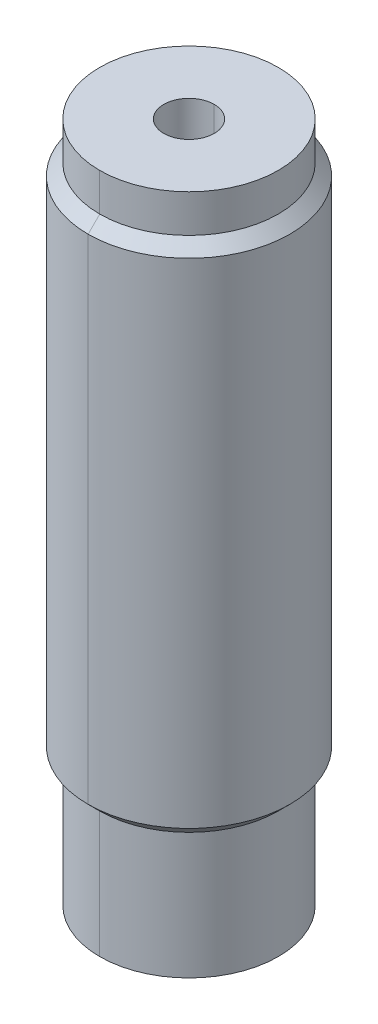
ISO-10303-21;
HEADER;
FILE_DESCRIPTION(('STEP AP214'),'2;1');
FILE_NAME('part.step','',(''),(''),'','','');
FILE_SCHEMA(('AUTOMOTIVE_DESIGN { 1 0 10303 214 1 1 1 1 }'));
ENDSEC;
DATA;
#1=APPLICATION_CONTEXT('core data for automotive mechanical design processes');
#2=APPLICATION_PROTOCOL_DEFINITION('international standard','automotive_design',2000,#1);
#3=PRODUCT_CONTEXT('',#1,'mechanical');
#4=PRODUCT('Part','Part','',(#3));
#5=PRODUCT_RELATED_PRODUCT_CATEGORY('part','',(#4));
#6=PRODUCT_DEFINITION_FORMATION('','',#4);
#7=PRODUCT_DEFINITION_CONTEXT('part definition',#1,'design');
#8=PRODUCT_DEFINITION('design','',#6,#7);
#9=PRODUCT_DEFINITION_SHAPE('','',#8);
#10=(LENGTH_UNIT() NAMED_UNIT(*) SI_UNIT(.MILLI.,.METRE.));
#11=(NAMED_UNIT(*) PLANE_ANGLE_UNIT() SI_UNIT($,.RADIAN.));
#12=(NAMED_UNIT(*) SI_UNIT($,.STERADIAN.) SOLID_ANGLE_UNIT());
#13=UNCERTAINTY_MEASURE_WITH_UNIT(LENGTH_MEASURE(1.E-05),#10,'distance_accuracy_value','');
#14=(GEOMETRIC_REPRESENTATION_CONTEXT(3) GLOBAL_UNCERTAINTY_ASSIGNED_CONTEXT((#13)) GLOBAL_UNIT_ASSIGNED_CONTEXT((#10,
#11,#12)) REPRESENTATION_CONTEXT('',''));
#15=CARTESIAN_POINT('',(0.,0.,0.));
#16=DIRECTION('',(0.,0.,1.));
#17=DIRECTION('',(1.,0.,0.));
#18=AXIS2_PLACEMENT_3D('',#15,#16,#17);
#19=CARTESIAN_POINT('',(0.,-5.,0.));
#20=DIRECTION('',(0.,-1.,0.));
#21=DIRECTION('',(1.,0.,0.));
#22=AXIS2_PLACEMENT_3D('',#19,#20,#21);
#23=CONICAL_SURFACE('',#22,1.,0.7853981634);
#24=DIRECTION('',(0.,-0.707106781184743,0.707106781188352));
#25=VECTOR('',#24,1.);
#26=CARTESIAN_POINT('',(0.,-4.0000000000051,0.));
#27=LINE('',#26,#25);
#28=CARTESIAN_POINT('',(0.,-4.,0.));
#29=VERTEX_POINT('',#28);
#30=CARTESIAN_POINT('',(0.,-5.,1.));
#31=VERTEX_POINT('',#30);
#32=EDGE_CURVE('E11',#29,#31,#27,.T.);
#33=ORIENTED_EDGE('',*,*,#32,.T.);
#34=CARTESIAN_POINT('',(0.,-5.,0.));
#35=DIRECTION('',(0.,-1.,0.));
#36=DIRECTION('',(0.,0.,-1.));
#37=AXIS2_PLACEMENT_3D('',#34,#35,#36);
#38=CIRCLE('',#37,1.);
#39=CARTESIAN_POINT('',(0.,-5.,-1.));
#40=VERTEX_POINT('',#39);
#41=EDGE_CURVE('E26',#31,#40,#38,.T.);
#42=ORIENTED_EDGE('',*,*,#41,.T.);
#43=DIRECTION('',(0.,-0.707106781184743,-0.707106781188352));
#44=VECTOR('',#43,1.);
#45=CARTESIAN_POINT('',(0.,-4.0000000000051,0.));
#46=LINE('',#45,#44);
#47=EDGE_CURVE('E255',#29,#40,#46,.T.);
#48=ORIENTED_EDGE('',*,*,#47,.F.);
#49=EDGE_LOOP('',(#33,#42,#48));
#50=FACE_BOUND('',#49,.T.);
#51=ADVANCED_FACE('F17',(#50),#23,.F.);
#52=CARTESIAN_POINT('',(0.,-5.,0.));
#53=DIRECTION('',(0.,-1.,0.));
#54=DIRECTION('',(-1.,0.,0.));
#55=AXIS2_PLACEMENT_3D('',#52,#53,#54);
#56=CONICAL_SURFACE('',#55,1.,0.7853981634);
#57=ORIENTED_EDGE('',*,*,#47,.T.);
#58=CARTESIAN_POINT('',(0.,-5.,0.));
#59=DIRECTION('',(0.,-1.,0.));
#60=DIRECTION('',(0.,0.,-1.));
#61=AXIS2_PLACEMENT_3D('',#58,#59,#60);
#62=CIRCLE('',#61,1.);
#63=EDGE_CURVE('E250',#40,#31,#62,.T.);
#64=ORIENTED_EDGE('',*,*,#63,.T.);
#65=ORIENTED_EDGE('',*,*,#32,.F.);
#66=EDGE_LOOP('',(#57,#64,#65));
#67=FACE_BOUND('',#66,.T.);
#68=ADVANCED_FACE('F269',(#67),#56,.F.);
#69=CARTESIAN_POINT('',(3.54,-5.,0.));
#70=DIRECTION('',(0.,1.,0.));
#71=DIRECTION('',(0.,0.,1.));
#72=AXIS2_PLACEMENT_3D('',#69,#70,#71);
#73=PLANE('',#72);
#74=ORIENTED_EDGE('',*,*,#63,.F.);
#75=ORIENTED_EDGE('',*,*,#41,.F.);
#76=EDGE_LOOP('',(#74,#75));
#77=FACE_BOUND('',#76,.T.);
#78=CARTESIAN_POINT('',(0.,-5.,0.));
#79=DIRECTION('',(0.,-1.,0.));
#80=DIRECTION('',(0.,0.,-1.));
#81=AXIS2_PLACEMENT_3D('',#78,#79,#80);
#82=CIRCLE('',#81,3.54);
#83=CARTESIAN_POINT('',(0.,-5.,-3.54));
#84=VERTEX_POINT('',#83);
#85=CARTESIAN_POINT('',(0.,-5.,3.54));
#86=VERTEX_POINT('',#85);
#87=EDGE_CURVE('E245',#84,#86,#82,.T.);
#88=ORIENTED_EDGE('',*,*,#87,.T.);
#89=CARTESIAN_POINT('',(0.,-5.,0.));
#90=DIRECTION('',(0.,-1.,0.));
#91=DIRECTION('',(0.,0.,-1.));
#92=AXIS2_PLACEMENT_3D('',#89,#90,#91);
#93=CIRCLE('',#92,3.54);
#94=EDGE_CURVE('E240',#86,#84,#93,.T.);
#95=ORIENTED_EDGE('',*,*,#94,.T.);
#96=EDGE_LOOP('',(#88,#95));
#97=FACE_BOUND('',#96,.T.);
#98=ADVANCED_FACE('F271',(#77,#97),#73,.F.);
#99=CARTESIAN_POINT('',(0.,-4.,0.));
#100=DIRECTION('',(0.,1.,0.));
#101=DIRECTION('',(1.,0.,0.));
#102=AXIS2_PLACEMENT_3D('',#99,#100,#101);
#103=CYLINDRICAL_SURFACE('',#102,3.54);
#104=CARTESIAN_POINT('',(0.,0.,0.));
#105=DIRECTION('',(0.,-1.,0.));
#106=DIRECTION('',(0.,0.,-1.));
#107=AXIS2_PLACEMENT_3D('',#104,#105,#106);
#108=CIRCLE('',#107,3.54);
#109=CARTESIAN_POINT('',(0.,0.,3.54));
#110=VERTEX_POINT('',#109);
#111=CARTESIAN_POINT('',(0.,0.,-3.54));
#112=VERTEX_POINT('',#111);
#113=EDGE_CURVE('E235',#110,#112,#108,.T.);
#114=ORIENTED_EDGE('',*,*,#113,.T.);
#115=DIRECTION('',(0.,1.,0.));
#116=VECTOR('',#115,1.);
#117=CARTESIAN_POINT('',(0.,-5.,-3.54));
#118=LINE('',#117,#116);
#119=EDGE_CURVE('E229',#84,#112,#118,.T.);
#120=ORIENTED_EDGE('',*,*,#119,.F.);
#121=ORIENTED_EDGE('',*,*,#94,.F.);
#122=DIRECTION('',(0.,1.,0.));
#123=VECTOR('',#122,1.);
#124=CARTESIAN_POINT('',(0.,-5.,3.54));
#125=LINE('',#124,#123);
#126=EDGE_CURVE('E224',#86,#110,#125,.T.);
#127=ORIENTED_EDGE('',*,*,#126,.T.);
#128=EDGE_LOOP('',(#114,#120,#121,#127));
#129=FACE_BOUND('',#128,.T.);
#130=ADVANCED_FACE('F274',(#129),#103,.T.);
#131=CARTESIAN_POINT('',(0.,-4.,0.));
#132=DIRECTION('',(0.,1.,0.));
#133=DIRECTION('',(-1.,0.,0.));
#134=AXIS2_PLACEMENT_3D('',#131,#132,#133);
#135=CYLINDRICAL_SURFACE('',#134,3.54);
#136=ORIENTED_EDGE('',*,*,#87,.F.);
#137=ORIENTED_EDGE('',*,*,#119,.T.);
#138=CARTESIAN_POINT('',(0.,0.,0.));
#139=DIRECTION('',(0.,-1.,0.));
#140=DIRECTION('',(0.,0.,-1.));
#141=AXIS2_PLACEMENT_3D('',#138,#139,#140);
#142=CIRCLE('',#141,3.54);
#143=EDGE_CURVE('E218',#112,#110,#142,.T.);
#144=ORIENTED_EDGE('',*,*,#143,.T.);
#145=ORIENTED_EDGE('',*,*,#126,.F.);
#146=EDGE_LOOP('',(#136,#137,#144,#145));
#147=FACE_BOUND('',#146,.T.);
#148=ADVANCED_FACE('F282',(#147),#135,.T.);
#149=CARTESIAN_POINT('',(0.,0.459999999999999,0.));
#150=DIRECTION('',(0.,1.,0.));
#151=DIRECTION('',(-1.,0.,0.));
#152=AXIS2_PLACEMENT_3D('',#149,#150,#151);
#153=CONICAL_SURFACE('',#152,4.,0.7853981634);
#154=ORIENTED_EDGE('',*,*,#143,.F.);
#155=DIRECTION('',(0.,0.707106781184743,-0.707106781188352));
#156=VECTOR('',#155,1.);
#157=CARTESIAN_POINT('',(0.,1.17322818127263E-12,-3.53999999999883));
#158=LINE('',#157,#156);
#159=CARTESIAN_POINT('',(0.,0.459999999999999,-4.));
#160=VERTEX_POINT('',#159);
#161=EDGE_CURVE('E213',#112,#160,#158,.T.);
#162=ORIENTED_EDGE('',*,*,#161,.T.);
#163=CARTESIAN_POINT('',(0.,0.459999999999999,0.));
#164=DIRECTION('',(0.,-1.,0.));
#165=DIRECTION('',(0.,0.,-1.));
#166=AXIS2_PLACEMENT_3D('',#163,#164,#165);
#167=CIRCLE('',#166,4.);
#168=CARTESIAN_POINT('',(0.,0.459999999999999,4.));
#169=VERTEX_POINT('',#168);
#170=EDGE_CURVE('E208',#160,#169,#167,.T.);
#171=ORIENTED_EDGE('',*,*,#170,.T.);
#172=DIRECTION('',(0.,0.707106781184743,0.707106781188352));
#173=VECTOR('',#172,1.);
#174=CARTESIAN_POINT('',(0.,1.1731726701214E-12,3.53999999999883));
#175=LINE('',#174,#173);
#176=EDGE_CURVE('E202',#110,#169,#175,.T.);
#177=ORIENTED_EDGE('',*,*,#176,.F.);
#178=EDGE_LOOP('',(#154,#162,#171,#177));
#179=FACE_BOUND('',#178,.T.);
#180=ADVANCED_FACE('F288',(#179),#153,.T.);
#181=CARTESIAN_POINT('',(0.,0.459999999999999,0.));
#182=DIRECTION('',(0.,1.,0.));
#183=DIRECTION('',(1.,0.,0.));
#184=AXIS2_PLACEMENT_3D('',#181,#182,#183);
#185=CONICAL_SURFACE('',#184,4.,0.7853981634);
#186=CARTESIAN_POINT('',(0.,0.459999999999999,0.));
#187=DIRECTION('',(0.,-1.,0.));
#188=DIRECTION('',(0.,0.,-1.));
#189=AXIS2_PLACEMENT_3D('',#186,#187,#188);
#190=CIRCLE('',#189,4.);
#191=EDGE_CURVE('E196',#169,#160,#190,.T.);
#192=ORIENTED_EDGE('',*,*,#191,.T.);
#193=ORIENTED_EDGE('',*,*,#161,.F.);
#194=ORIENTED_EDGE('',*,*,#113,.F.);
#195=ORIENTED_EDGE('',*,*,#176,.T.);
#196=EDGE_LOOP('',(#192,#193,#194,#195));
#197=FACE_BOUND('',#196,.T.);
#198=ADVANCED_FACE('F292',(#197),#185,.T.);
#199=CARTESIAN_POINT('',(0.,-4.,0.));
#200=DIRECTION('',(0.,1.,0.));
#201=DIRECTION('',(1.,0.,0.));
#202=AXIS2_PLACEMENT_3D('',#199,#200,#201);
#203=CYLINDRICAL_SURFACE('',#202,4.);
#204=CARTESIAN_POINT('',(0.,20.04,0.));
#205=DIRECTION('',(0.,-1.,0.));
#206=DIRECTION('',(0.,0.,-1.));
#207=AXIS2_PLACEMENT_3D('',#204,#205,#206);
#208=CIRCLE('',#207,4.);
#209=CARTESIAN_POINT('',(0.,20.04,4.));
#210=VERTEX_POINT('',#209);
#211=CARTESIAN_POINT('',(0.,20.04,-4.));
#212=VERTEX_POINT('',#211);
#213=EDGE_CURVE('E191',#210,#212,#208,.T.);
#214=ORIENTED_EDGE('',*,*,#213,.T.);
#215=DIRECTION('',(0.,1.,0.));
#216=VECTOR('',#215,1.);
#217=CARTESIAN_POINT('',(0.,0.460000000000001,-4.));
#218=LINE('',#217,#216);
#219=EDGE_CURVE('E185',#160,#212,#218,.T.);
#220=ORIENTED_EDGE('',*,*,#219,.F.);
#221=ORIENTED_EDGE('',*,*,#191,.F.);
#222=DIRECTION('',(0.,1.,0.));
#223=VECTOR('',#222,1.);
#224=CARTESIAN_POINT('',(0.,0.460000000000001,4.));
#225=LINE('',#224,#223);
#226=EDGE_CURVE('E180',#169,#210,#225,.T.);
#227=ORIENTED_EDGE('',*,*,#226,.T.);
#228=EDGE_LOOP('',(#214,#220,#221,#227));
#229=FACE_BOUND('',#228,.T.);
#230=ADVANCED_FACE('F296',(#229),#203,.T.);
#231=CARTESIAN_POINT('',(0.,-4.,0.));
#232=DIRECTION('',(0.,1.,0.));
#233=DIRECTION('',(-1.,0.,0.));
#234=AXIS2_PLACEMENT_3D('',#231,#232,#233);
#235=CYLINDRICAL_SURFACE('',#234,4.);
#236=ORIENTED_EDGE('',*,*,#170,.F.);
#237=ORIENTED_EDGE('',*,*,#219,.T.);
#238=CARTESIAN_POINT('',(0.,20.04,0.));
#239=DIRECTION('',(0.,-1.,0.));
#240=DIRECTION('',(0.,0.,-1.));
#241=AXIS2_PLACEMENT_3D('',#238,#239,#240);
#242=CIRCLE('',#241,4.);
#243=EDGE_CURVE('E174',#212,#210,#242,.T.);
#244=ORIENTED_EDGE('',*,*,#243,.T.);
#245=ORIENTED_EDGE('',*,*,#226,.F.);
#246=EDGE_LOOP('',(#236,#237,#244,#245));
#247=FACE_BOUND('',#246,.T.);
#248=ADVANCED_FACE('F300',(#247),#235,.T.);
#249=CARTESIAN_POINT('',(0.,20.5,0.));
#250=DIRECTION('',(0.,-1.,0.));
#251=DIRECTION('',(-1.,0.,0.));
#252=AXIS2_PLACEMENT_3D('',#249,#250,#251);
#253=CONICAL_SURFACE('',#252,3.54,0.7853981634);
#254=ORIENTED_EDGE('',*,*,#243,.F.);
#255=DIRECTION('',(0.,-0.707106781184745,-0.70710678118835));
#256=VECTOR('',#255,1.);
#257=CARTESIAN_POINT('',(0.,20.5,-3.54));
#258=LINE('',#257,#256);
#259=CARTESIAN_POINT('',(0.,20.5,-3.54));
#260=VERTEX_POINT('',#259);
#261=EDGE_CURVE('E168',#260,#212,#258,.T.);
#262=ORIENTED_EDGE('',*,*,#261,.F.);
#263=CARTESIAN_POINT('',(0.,20.5,0.));
#264=DIRECTION('',(0.,-1.,0.));
#265=DIRECTION('',(0.,0.,-1.));
#266=AXIS2_PLACEMENT_3D('',#263,#264,#265);
#267=CIRCLE('',#266,3.54);
#268=CARTESIAN_POINT('',(0.,20.5,3.54));
#269=VERTEX_POINT('',#268);
#270=EDGE_CURVE('E163',#260,#269,#267,.T.);
#271=ORIENTED_EDGE('',*,*,#270,.T.);
#272=DIRECTION('',(0.,-0.707106781184745,0.70710678118835));
#273=VECTOR('',#272,1.);
#274=CARTESIAN_POINT('',(0.,20.5,3.54));
#275=LINE('',#274,#273);
#276=EDGE_CURVE('E157',#269,#210,#275,.T.);
#277=ORIENTED_EDGE('',*,*,#276,.T.);
#278=EDGE_LOOP('',(#254,#262,#271,#277));
#279=FACE_BOUND('',#278,.T.);
#280=ADVANCED_FACE('F303',(#279),#253,.T.);
#281=CARTESIAN_POINT('',(0.,20.5,0.));
#282=DIRECTION('',(0.,-1.,0.));
#283=DIRECTION('',(1.,0.,0.));
#284=AXIS2_PLACEMENT_3D('',#281,#282,#283);
#285=CONICAL_SURFACE('',#284,3.54,0.7853981634);
#286=CARTESIAN_POINT('',(0.,20.5,0.));
#287=DIRECTION('',(0.,-1.,0.));
#288=DIRECTION('',(0.,0.,-1.));
#289=AXIS2_PLACEMENT_3D('',#286,#287,#288);
#290=CIRCLE('',#289,3.54);
#291=EDGE_CURVE('E151',#269,#260,#290,.T.);
#292=ORIENTED_EDGE('',*,*,#291,.T.);
#293=ORIENTED_EDGE('',*,*,#261,.T.);
#294=ORIENTED_EDGE('',*,*,#213,.F.);
#295=ORIENTED_EDGE('',*,*,#276,.F.);
#296=EDGE_LOOP('',(#292,#293,#294,#295));
#297=FACE_BOUND('',#296,.T.);
#298=ADVANCED_FACE('F307',(#297),#285,.T.);
#299=CARTESIAN_POINT('',(0.,-4.,0.));
#300=DIRECTION('',(0.,1.,0.));
#301=DIRECTION('',(1.,0.,0.));
#302=AXIS2_PLACEMENT_3D('',#299,#300,#301);
#303=CYLINDRICAL_SURFACE('',#302,3.54);
#304=CARTESIAN_POINT('',(0.,22.,0.));
#305=DIRECTION('',(0.,-1.,0.));
#306=DIRECTION('',(0.,0.,-1.));
#307=AXIS2_PLACEMENT_3D('',#304,#305,#306);
#308=CIRCLE('',#307,3.54);
#309=CARTESIAN_POINT('',(0.,22.,3.54));
#310=VERTEX_POINT('',#309);
#311=CARTESIAN_POINT('',(0.,22.,-3.54));
#312=VERTEX_POINT('',#311);
#313=EDGE_CURVE('E146',#310,#312,#308,.T.);
#314=ORIENTED_EDGE('',*,*,#313,.T.);
#315=DIRECTION('',(0.,1.,0.));
#316=VECTOR('',#315,1.);
#317=CARTESIAN_POINT('',(0.,20.5,-3.54));
#318=LINE('',#317,#316);
#319=EDGE_CURVE('E140',#260,#312,#318,.T.);
#320=ORIENTED_EDGE('',*,*,#319,.F.);
#321=ORIENTED_EDGE('',*,*,#291,.F.);
#322=DIRECTION('',(0.,1.,0.));
#323=VECTOR('',#322,1.);
#324=CARTESIAN_POINT('',(0.,20.5,3.54));
#325=LINE('',#324,#323);
#326=EDGE_CURVE('E135',#269,#310,#325,.T.);
#327=ORIENTED_EDGE('',*,*,#326,.T.);
#328=EDGE_LOOP('',(#314,#320,#321,#327));
#329=FACE_BOUND('',#328,.T.);
#330=ADVANCED_FACE('F311',(#329),#303,.T.);
#331=CARTESIAN_POINT('',(0.,-4.,0.));
#332=DIRECTION('',(0.,1.,0.));
#333=DIRECTION('',(-1.,0.,0.));
#334=AXIS2_PLACEMENT_3D('',#331,#332,#333);
#335=CYLINDRICAL_SURFACE('',#334,3.54);
#336=ORIENTED_EDGE('',*,*,#270,.F.);
#337=ORIENTED_EDGE('',*,*,#319,.T.);
#338=CARTESIAN_POINT('',(0.,22.,0.));
#339=DIRECTION('',(0.,-1.,0.));
#340=DIRECTION('',(0.,0.,-1.));
#341=AXIS2_PLACEMENT_3D('',#338,#339,#340);
#342=CIRCLE('',#341,3.54);
#343=EDGE_CURVE('E129',#312,#310,#342,.T.);
#344=ORIENTED_EDGE('',*,*,#343,.T.);
#345=ORIENTED_EDGE('',*,*,#326,.F.);
#346=EDGE_LOOP('',(#336,#337,#344,#345));
#347=FACE_BOUND('',#346,.T.);
#348=ADVANCED_FACE('F315',(#347),#335,.T.);
#349=CARTESIAN_POINT('',(0.,22.,0.));
#350=DIRECTION('',(0.,-1.,0.));
#351=DIRECTION('',(0.,0.,-1.));
#352=AXIS2_PLACEMENT_3D('',#349,#350,#351);
#353=PLANE('',#352);
#354=ORIENTED_EDGE('',*,*,#343,.F.);
#355=ORIENTED_EDGE('',*,*,#313,.F.);
#356=EDGE_LOOP('',(#354,#355));
#357=FACE_BOUND('',#356,.T.);
#358=CARTESIAN_POINT('',(0.,22.,0.));
#359=DIRECTION('',(0.,-1.,0.));
#360=DIRECTION('',(0.,0.,-1.));
#361=AXIS2_PLACEMENT_3D('',#358,#359,#360);
#362=CIRCLE('',#361,1.);
#363=CARTESIAN_POINT('',(0.,22.,-1.));
#364=VERTEX_POINT('',#363);
#365=CARTESIAN_POINT('',(0.,22.,1.));
#366=VERTEX_POINT('',#365);
#367=EDGE_CURVE('E104',#364,#366,#362,.T.);
#368=ORIENTED_EDGE('',*,*,#367,.T.);
#369=CARTESIAN_POINT('',(0.,22.,0.));
#370=DIRECTION('',(0.,-1.,0.));
#371=DIRECTION('',(0.,0.,-1.));
#372=AXIS2_PLACEMENT_3D('',#369,#370,#371);
#373=CIRCLE('',#372,1.);
#374=EDGE_CURVE('E120',#366,#364,#373,.T.);
#375=ORIENTED_EDGE('',*,*,#374,.T.);
#376=EDGE_LOOP('',(#368,#375));
#377=FACE_BOUND('',#376,.T.);
#378=ADVANCED_FACE('F317',(#357,#377),#353,.F.);
#379=CARTESIAN_POINT('',(0.,0.,0.));
#380=DIRECTION('',(0.,1.,0.));
#381=DIRECTION('',(1.,0.,0.));
#382=AXIS2_PLACEMENT_3D('',#379,#380,#381);
#383=CYLINDRICAL_SURFACE('',#382,1.);
#384=ORIENTED_EDGE('',*,*,#374,.F.);
#385=DIRECTION('',(0.,1.,0.));
#386=VECTOR('',#385,1.);
#387=CARTESIAN_POINT('',(0.,0.,1.));
#388=LINE('',#387,#386);
#389=CARTESIAN_POINT('',(0.,0.,1.));
#390=VERTEX_POINT('',#389);
#391=EDGE_CURVE('E95',#390,#366,#388,.T.);
#392=ORIENTED_EDGE('',*,*,#391,.F.);
#393=CARTESIAN_POINT('',(0.,0.,0.));
#394=DIRECTION('',(0.,-1.,0.));
#395=DIRECTION('',(0.,0.,-1.));
#396=AXIS2_PLACEMENT_3D('',#393,#394,#395);
#397=CIRCLE('',#396,1.);
#398=CARTESIAN_POINT('',(0.,0.,-1.));
#399=VERTEX_POINT('',#398);
#400=EDGE_CURVE('E88',#390,#399,#397,.T.);
#401=ORIENTED_EDGE('',*,*,#400,.T.);
#402=DIRECTION('',(0.,1.,0.));
#403=VECTOR('',#402,1.);
#404=CARTESIAN_POINT('',(0.,0.,-1.));
#405=LINE('',#404,#403);
#406=EDGE_CURVE('E92',#399,#364,#405,.T.);
#407=ORIENTED_EDGE('',*,*,#406,.T.);
#408=EDGE_LOOP('',(#384,#392,#401,#407));
#409=FACE_BOUND('',#408,.T.);
#410=ADVANCED_FACE('F91',(#409),#383,.F.);
#411=CARTESIAN_POINT('',(0.,0.,0.));
#412=DIRECTION('',(0.,1.,0.));
#413=DIRECTION('',(-1.,0.,0.));
#414=AXIS2_PLACEMENT_3D('',#411,#412,#413);
#415=CYLINDRICAL_SURFACE('',#414,1.);
#416=CARTESIAN_POINT('',(0.,0.,0.));
#417=DIRECTION('',(0.,-1.,0.));
#418=DIRECTION('',(0.,0.,-1.));
#419=AXIS2_PLACEMENT_3D('',#416,#417,#418);
#420=CIRCLE('',#419,1.);
#421=EDGE_CURVE('E103',#399,#390,#420,.T.);
#422=ORIENTED_EDGE('',*,*,#421,.T.);
#423=ORIENTED_EDGE('',*,*,#391,.T.);
#424=ORIENTED_EDGE('',*,*,#367,.F.);
#425=ORIENTED_EDGE('',*,*,#406,.F.);
#426=EDGE_LOOP('',(#422,#423,#424,#425));
#427=FACE_BOUND('',#426,.T.);
#428=ADVANCED_FACE('F102',(#427),#415,.F.);
#429=CARTESIAN_POINT('',(1.,0.,0.));
#430=DIRECTION('',(0.,1.,0.));
#431=DIRECTION('',(0.,0.,1.));
#432=AXIS2_PLACEMENT_3D('',#429,#430,#431);
#433=PLANE('',#432);
#434=ORIENTED_EDGE('',*,*,#421,.F.);
#435=ORIENTED_EDGE('',*,*,#400,.F.);
#436=EDGE_LOOP('',(#434,#435));
#437=FACE_BOUND('',#436,.T.);
#438=ADVANCED_FACE('F107',(#437),#433,.T.);
#439=CLOSED_SHELL('',(#51,#68,#98,#130,#148,#180,#198,#230,#248,#280,#298,#330,#348,#378,#410,
#428,#438));
#440=MANIFOLD_SOLID_BREP('B1',#439);
#441=ADVANCED_BREP_SHAPE_REPRESENTATION('',(#18,#440),#14);
#442=SHAPE_DEFINITION_REPRESENTATION(#9,#441);
ENDSEC;
END-ISO-10303-21;
